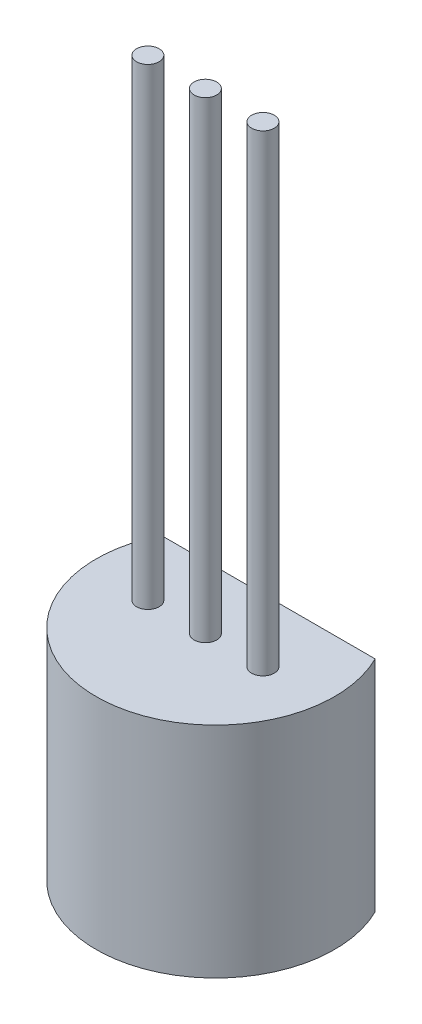
ISO-10303-21;
HEADER;
FILE_DESCRIPTION(('STEP AP214'),'2;1');
FILE_NAME('part.step','',(''),(''),'','','');
FILE_SCHEMA(('AUTOMOTIVE_DESIGN { 1 0 10303 214 1 1 1 1 }'));
ENDSEC;
DATA;
#1=APPLICATION_CONTEXT('core data for automotive mechanical design processes');
#2=APPLICATION_PROTOCOL_DEFINITION('international standard','automotive_design',2000,#1);
#3=PRODUCT_CONTEXT('',#1,'mechanical');
#4=PRODUCT('Part','Part','',(#3));
#5=PRODUCT_RELATED_PRODUCT_CATEGORY('part','',(#4));
#6=PRODUCT_DEFINITION_FORMATION('','',#4);
#7=PRODUCT_DEFINITION_CONTEXT('part definition',#1,'design');
#8=PRODUCT_DEFINITION('design','',#6,#7);
#9=PRODUCT_DEFINITION_SHAPE('','',#8);
#10=(LENGTH_UNIT() NAMED_UNIT(*) SI_UNIT(.MILLI.,.METRE.));
#11=(NAMED_UNIT(*) PLANE_ANGLE_UNIT() SI_UNIT($,.RADIAN.));
#12=(NAMED_UNIT(*) SI_UNIT($,.STERADIAN.) SOLID_ANGLE_UNIT());
#13=UNCERTAINTY_MEASURE_WITH_UNIT(LENGTH_MEASURE(1.E-05),#10,'distance_accuracy_value','');
#14=(GEOMETRIC_REPRESENTATION_CONTEXT(3) GLOBAL_UNCERTAINTY_ASSIGNED_CONTEXT((#13)) GLOBAL_UNIT_ASSIGNED_CONTEXT((#10,
#11,#12)) REPRESENTATION_CONTEXT('',''));
#15=CARTESIAN_POINT('',(0.,0.,0.));
#16=DIRECTION('',(0.,0.,1.));
#17=DIRECTION('',(1.,0.,0.));
#18=AXIS2_PLACEMENT_3D('',#15,#16,#17);
#19=CARTESIAN_POINT('',(0.,5.33,1.28831742243437));
#20=DIRECTION('',(0.,-1.,0.));
#21=DIRECTION('',(0.,0.,-1.));
#22=AXIS2_PLACEMENT_3D('',#19,#20,#21);
#23=CYLINDRICAL_SURFACE('',#22,2.90168257756563);
#24=CARTESIAN_POINT('',(0.,0.,1.28831742243437));
#25=DIRECTION('',(0.,1.,0.));
#26=DIRECTION('',(0.,0.,-1.));
#27=AXIS2_PLACEMENT_3D('',#24,#25,#26);
#28=CIRCLE('',#27,2.90168257756563);
#29=CARTESIAN_POINT('',(-2.6,0.,0.));
#30=VERTEX_POINT('',#29);
#31=CARTESIAN_POINT('',(2.6,0.,0.));
#32=VERTEX_POINT('',#31);
#33=EDGE_CURVE('E71',#30,#32,#28,.T.);
#34=ORIENTED_EDGE('',*,*,#33,.T.);
#35=DIRECTION('',(0.,-1.,0.));
#36=VECTOR('',#35,1.);
#37=CARTESIAN_POINT('',(2.6,5.33,0.));
#38=LINE('',#37,#36);
#39=CARTESIAN_POINT('',(2.6,5.33,0.));
#40=VERTEX_POINT('',#39);
#41=EDGE_CURVE('E68',#40,#32,#38,.T.);
#42=ORIENTED_EDGE('',*,*,#41,.F.);
#43=CARTESIAN_POINT('',(0.,5.33,1.28831742243437));
#44=DIRECTION('',(0.,1.,0.));
#45=DIRECTION('',(0.,0.,-1.));
#46=AXIS2_PLACEMENT_3D('',#43,#44,#45);
#47=CIRCLE('',#46,2.90168257756563);
#48=CARTESIAN_POINT('',(-2.6,5.33,0.));
#49=VERTEX_POINT('',#48);
#50=EDGE_CURVE('E70',#49,#40,#47,.T.);
#51=ORIENTED_EDGE('',*,*,#50,.F.);
#52=DIRECTION('',(0.,-1.,0.));
#53=VECTOR('',#52,1.);
#54=CARTESIAN_POINT('',(-2.6,5.33,0.));
#55=LINE('',#54,#53);
#56=EDGE_CURVE('E65',#49,#30,#55,.T.);
#57=ORIENTED_EDGE('',*,*,#56,.T.);
#58=EDGE_LOOP('',(#34,#42,#51,#57));
#59=FACE_BOUND('',#58,.T.);
#60=ADVANCED_FACE('F37',(#59),#23,.T.);
#61=CARTESIAN_POINT('',(-2.6,5.33,0.));
#62=DIRECTION('',(0.,0.,1.));
#63=DIRECTION('',(1.,0.,0.));
#64=AXIS2_PLACEMENT_3D('',#61,#62,#63);
#65=PLANE('',#64);
#66=DIRECTION('',(-1.,0.,0.));
#67=VECTOR('',#66,1.);
#68=CARTESIAN_POINT('',(-2.6,0.,0.));
#69=LINE('',#68,#67);
#70=EDGE_CURVE('E60',#32,#30,#69,.T.);
#71=ORIENTED_EDGE('',*,*,#70,.T.);
#72=ORIENTED_EDGE('',*,*,#56,.F.);
#73=DIRECTION('',(-1.,0.,0.));
#74=VECTOR('',#73,1.);
#75=CARTESIAN_POINT('',(-2.6,5.33,0.));
#76=LINE('',#75,#74);
#77=EDGE_CURVE('E52',#40,#49,#76,.T.);
#78=ORIENTED_EDGE('',*,*,#77,.F.);
#79=ORIENTED_EDGE('',*,*,#41,.T.);
#80=EDGE_LOOP('',(#71,#72,#78,#79));
#81=FACE_BOUND('',#80,.T.);
#82=ADVANCED_FACE('F64',(#81),#65,.F.);
#83=CARTESIAN_POINT('',(0.,5.33,1.28831742243437));
#84=DIRECTION('',(0.,-1.,0.));
#85=DIRECTION('',(0.,0.,-1.));
#86=AXIS2_PLACEMENT_3D('',#83,#84,#85);
#87=PLANE('',#86);
#88=CARTESIAN_POINT('',(1.4,5.33,1.53));
#89=DIRECTION('',(0.,-1.,0.));
#90=DIRECTION('',(0.,0.,-1.));
#91=AXIS2_PLACEMENT_3D('',#88,#89,#90);
#92=CIRCLE('',#91,0.275);
#93=CARTESIAN_POINT('',(1.4,5.33,1.255));
#94=VERTEX_POINT('',#93);
#95=EDGE_CURVE('E11',#94,#94,#92,.F.);
#96=ORIENTED_EDGE('',*,*,#95,.F.);
#97=EDGE_LOOP('',(#96));
#98=FACE_BOUND('',#97,.T.);
#99=CARTESIAN_POINT('',(-1.4,5.33,1.53));
#100=DIRECTION('',(0.,1.,0.));
#101=DIRECTION('',(0.,0.,1.));
#102=AXIS2_PLACEMENT_3D('',#99,#100,#101);
#103=CIRCLE('',#102,0.275);
#104=CARTESIAN_POINT('',(-1.4,5.33,1.805));
#105=VERTEX_POINT('',#104);
#106=EDGE_CURVE('E94',#105,#105,#103,.F.);
#107=ORIENTED_EDGE('',*,*,#106,.T.);
#108=EDGE_LOOP('',(#107));
#109=FACE_BOUND('',#108,.T.);
#110=CARTESIAN_POINT('',(0.,5.33,1.53));
#111=DIRECTION('',(0.,-1.,0.));
#112=DIRECTION('',(0.,0.,-1.));
#113=AXIS2_PLACEMENT_3D('',#110,#111,#112);
#114=CIRCLE('',#113,0.275);
#115=CARTESIAN_POINT('',(0.,5.33,1.255));
#116=VERTEX_POINT('',#115);
#117=EDGE_CURVE('E45',#116,#116,#114,.F.);
#118=ORIENTED_EDGE('',*,*,#117,.F.);
#119=EDGE_LOOP('',(#118));
#120=FACE_BOUND('',#119,.T.);
#121=ORIENTED_EDGE('',*,*,#50,.T.);
#122=ORIENTED_EDGE('',*,*,#77,.T.);
#123=EDGE_LOOP('',(#121,#122));
#124=FACE_BOUND('',#123,.T.);
#125=ADVANCED_FACE('F89',(#98,#109,#120,#124),#87,.F.);
#126=CARTESIAN_POINT('',(0.,0.,1.28831742243437));
#127=DIRECTION('',(0.,-1.,0.));
#128=DIRECTION('',(0.,0.,-1.));
#129=AXIS2_PLACEMENT_3D('',#126,#127,#128);
#130=PLANE('',#129);
#131=ORIENTED_EDGE('',*,*,#33,.F.);
#132=ORIENTED_EDGE('',*,*,#70,.F.);
#133=EDGE_LOOP('',(#131,#132));
#134=FACE_BOUND('',#133,.T.);
#135=ADVANCED_FACE('F75',(#134),#130,.T.);
#136=CARTESIAN_POINT('',(0.,16.8143171903377,1.53));
#137=DIRECTION('',(0.,-1.,0.));
#138=DIRECTION('',(0.,0.,-1.));
#139=AXIS2_PLACEMENT_3D('',#136,#137,#138);
#140=CYLINDRICAL_SURFACE('',#139,0.275);
#141=CARTESIAN_POINT('',(0.,16.8143171903377,1.53));
#142=DIRECTION('',(0.,1.,0.));
#143=DIRECTION('',(0.,0.,1.));
#144=AXIS2_PLACEMENT_3D('',#141,#142,#143);
#145=CIRCLE('',#144,0.275);
#146=CARTESIAN_POINT('',(0.,16.8143171903377,1.805));
#147=VERTEX_POINT('',#146);
#148=EDGE_CURVE('E76',#147,#147,#145,.T.);
#149=ORIENTED_EDGE('',*,*,#148,.F.);
#150=EDGE_LOOP('',(#149));
#151=FACE_BOUND('',#150,.T.);
#152=ORIENTED_EDGE('',*,*,#117,.T.);
#153=EDGE_LOOP('',(#152));
#154=FACE_BOUND('',#153,.T.);
#155=ADVANCED_FACE('F87',(#151,#154),#140,.T.);
#156=CARTESIAN_POINT('',(0.,16.8143171903377,0.));
#157=DIRECTION('',(0.,1.,0.));
#158=DIRECTION('',(0.,0.,1.));
#159=AXIS2_PLACEMENT_3D('',#156,#157,#158);
#160=PLANE('',#159);
#161=ORIENTED_EDGE('',*,*,#148,.T.);
#162=EDGE_LOOP('',(#161));
#163=FACE_BOUND('',#162,.T.);
#164=ADVANCED_FACE('F116',(#163),#160,.T.);
#165=CARTESIAN_POINT('',(-1.4,16.8143171903377,1.53));
#166=DIRECTION('',(0.,-1.,0.));
#167=DIRECTION('',(0.,0.,-1.));
#168=AXIS2_PLACEMENT_3D('',#165,#166,#167);
#169=CYLINDRICAL_SURFACE('',#168,0.275);
#170=CARTESIAN_POINT('',(-1.4,16.8143171903377,1.53));
#171=DIRECTION('',(0.,1.,0.));
#172=DIRECTION('',(0.,0.,1.));
#173=AXIS2_PLACEMENT_3D('',#170,#171,#172);
#174=CIRCLE('',#173,0.275);
#175=CARTESIAN_POINT('',(-1.4,16.8143171903377,1.805));
#176=VERTEX_POINT('',#175);
#177=EDGE_CURVE('E79',#176,#176,#174,.F.);
#178=ORIENTED_EDGE('',*,*,#177,.T.);
#179=EDGE_LOOP('',(#178));
#180=FACE_BOUND('',#179,.T.);
#181=ORIENTED_EDGE('',*,*,#106,.F.);
#182=EDGE_LOOP('',(#181));
#183=FACE_BOUND('',#182,.T.);
#184=ADVANCED_FACE('F114',(#180,#183),#169,.T.);
#185=CARTESIAN_POINT('',(0.,16.8143171903377,0.));
#186=DIRECTION('',(0.,1.,0.));
#187=DIRECTION('',(0.,0.,1.));
#188=AXIS2_PLACEMENT_3D('',#185,#186,#187);
#189=PLANE('',#188);
#190=ORIENTED_EDGE('',*,*,#177,.F.);
#191=EDGE_LOOP('',(#190));
#192=FACE_BOUND('',#191,.T.);
#193=ADVANCED_FACE('F108',(#192),#189,.T.);
#194=CARTESIAN_POINT('',(1.4,16.8143171903377,1.53));
#195=DIRECTION('',(0.,-1.,0.));
#196=DIRECTION('',(0.,0.,-1.));
#197=AXIS2_PLACEMENT_3D('',#194,#195,#196);
#198=CYLINDRICAL_SURFACE('',#197,0.275);
#199=CARTESIAN_POINT('',(1.4,16.8143171903377,1.53));
#200=DIRECTION('',(0.,1.,0.));
#201=DIRECTION('',(0.,0.,1.));
#202=AXIS2_PLACEMENT_3D('',#199,#200,#201);
#203=CIRCLE('',#202,0.275);
#204=CARTESIAN_POINT('',(1.4,16.8143171903377,1.805));
#205=VERTEX_POINT('',#204);
#206=EDGE_CURVE('E97',#205,#205,#203,.T.);
#207=ORIENTED_EDGE('',*,*,#206,.F.);
#208=EDGE_LOOP('',(#207));
#209=FACE_BOUND('',#208,.T.);
#210=ORIENTED_EDGE('',*,*,#95,.T.);
#211=EDGE_LOOP('',(#210));
#212=FACE_BOUND('',#211,.T.);
#213=ADVANCED_FACE('F105',(#209,#212),#198,.T.);
#214=CARTESIAN_POINT('',(0.,16.8143171903377,0.));
#215=DIRECTION('',(0.,1.,0.));
#216=DIRECTION('',(0.,0.,1.));
#217=AXIS2_PLACEMENT_3D('',#214,#215,#216);
#218=PLANE('',#217);
#219=ORIENTED_EDGE('',*,*,#206,.T.);
#220=EDGE_LOOP('',(#219));
#221=FACE_BOUND('',#220,.T.);
#222=ADVANCED_FACE('F103',(#221),#218,.T.);
#223=CLOSED_SHELL('',(#60,#82,#125,#135,#155,#164,#184,#193,#213,#222));
#224=MANIFOLD_SOLID_BREP('B2',#223);
#225=ADVANCED_BREP_SHAPE_REPRESENTATION('',(#18,#224),#14);
#226=SHAPE_DEFINITION_REPRESENTATION(#9,#225);
ENDSEC;
END-ISO-10303-21;
